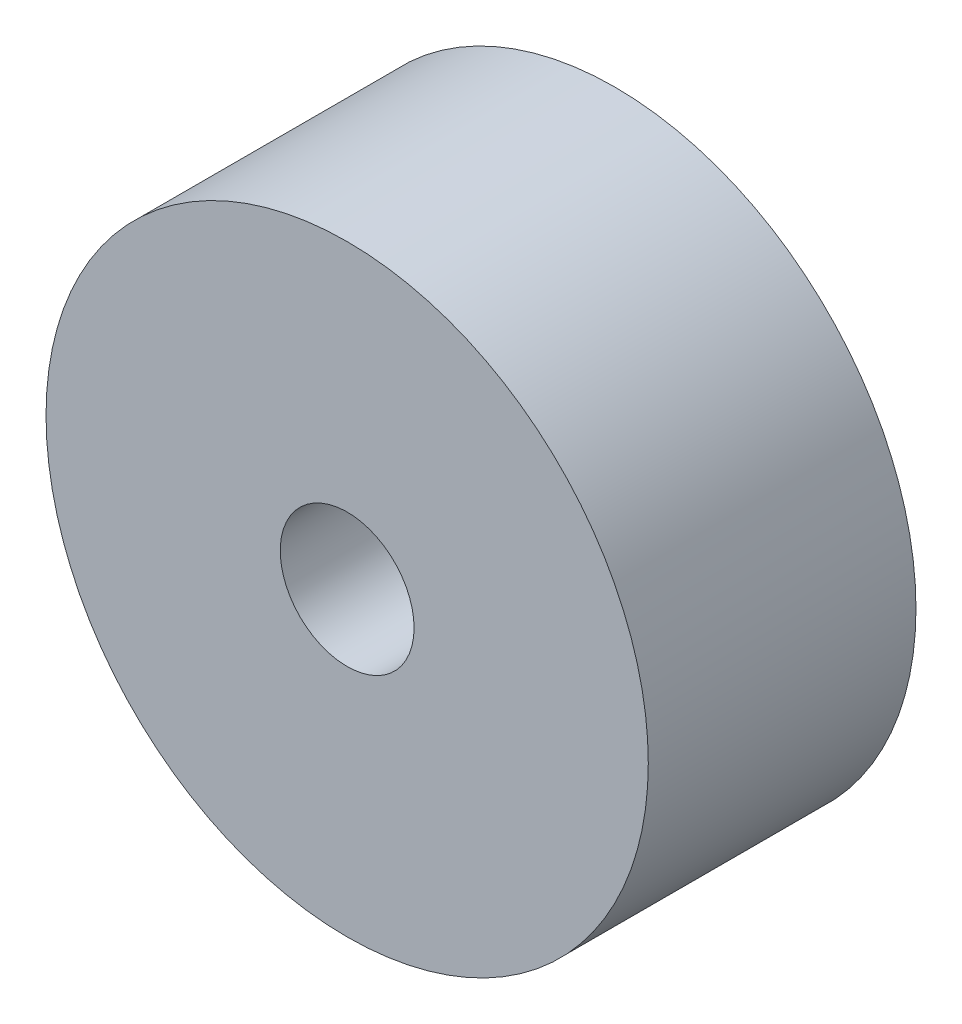
ISO-10303-21;
HEADER;
FILE_DESCRIPTION(('STEP AP214'),'2;1');
FILE_NAME('part.step','',(''),(''),'','','');
FILE_SCHEMA(('AUTOMOTIVE_DESIGN { 1 0 10303 214 1 1 1 1 }'));
ENDSEC;
DATA;
#1=APPLICATION_CONTEXT('core data for automotive mechanical design processes');
#2=APPLICATION_PROTOCOL_DEFINITION('international standard','automotive_design',2000,#1);
#3=PRODUCT_CONTEXT('',#1,'mechanical');
#4=PRODUCT('Part','Part','',(#3));
#5=PRODUCT_RELATED_PRODUCT_CATEGORY('part','',(#4));
#6=PRODUCT_DEFINITION_FORMATION('','',#4);
#7=PRODUCT_DEFINITION_CONTEXT('part definition',#1,'design');
#8=PRODUCT_DEFINITION('design','',#6,#7);
#9=PRODUCT_DEFINITION_SHAPE('','',#8);
#10=(LENGTH_UNIT() NAMED_UNIT(*) SI_UNIT(.MILLI.,.METRE.));
#11=(NAMED_UNIT(*) PLANE_ANGLE_UNIT() SI_UNIT($,.RADIAN.));
#12=(NAMED_UNIT(*) SI_UNIT($,.STERADIAN.) SOLID_ANGLE_UNIT());
#13=UNCERTAINTY_MEASURE_WITH_UNIT(LENGTH_MEASURE(1.E-05),#10,'distance_accuracy_value','');
#14=(GEOMETRIC_REPRESENTATION_CONTEXT(3) GLOBAL_UNCERTAINTY_ASSIGNED_CONTEXT((#13)) GLOBAL_UNIT_ASSIGNED_CONTEXT((#10,
#11,#12)) REPRESENTATION_CONTEXT('',''));
#15=CARTESIAN_POINT('',(0.,0.,0.));
#16=DIRECTION('',(0.,0.,1.));
#17=DIRECTION('',(1.,0.,0.));
#18=AXIS2_PLACEMENT_3D('',#15,#16,#17);
#19=CARTESIAN_POINT('',(0.,0.,20.));
#20=DIRECTION('',(0.,0.,1.));
#21=DIRECTION('',(1.,0.,0.));
#22=AXIS2_PLACEMENT_3D('',#19,#20,#21);
#23=PLANE('',#22);
#24=CARTESIAN_POINT('',(0.,0.,20.));
#25=DIRECTION('',(0.,0.,1.));
#26=DIRECTION('',(1.,0.,0.));
#27=AXIS2_PLACEMENT_3D('',#24,#25,#26);
#28=CIRCLE('',#27,22.5);
#29=CARTESIAN_POINT('',(22.5,0.,20.));
#30=VERTEX_POINT('',#29);
#31=EDGE_CURVE('E10',#30,#30,#28,.T.);
#32=ORIENTED_EDGE('',*,*,#31,.T.);
#33=EDGE_LOOP('',(#32));
#34=FACE_BOUND('',#33,.T.);
#35=CARTESIAN_POINT('',(0.,0.,20.));
#36=DIRECTION('',(0.,0.,1.));
#37=DIRECTION('',(1.,0.,0.));
#38=AXIS2_PLACEMENT_3D('',#35,#36,#37);
#39=CIRCLE('',#38,5.);
#40=CARTESIAN_POINT('',(5.,0.,20.));
#41=VERTEX_POINT('',#40);
#42=EDGE_CURVE('E43',#41,#41,#39,.T.);
#43=ORIENTED_EDGE('',*,*,#42,.F.);
#44=EDGE_LOOP('',(#43));
#45=FACE_BOUND('',#44,.T.);
#46=ADVANCED_FACE('F32',(#34,#45),#23,.T.);
#47=CARTESIAN_POINT('',(0.,0.,0.));
#48=DIRECTION('',(0.,0.,1.));
#49=DIRECTION('',(1.,0.,0.));
#50=AXIS2_PLACEMENT_3D('',#47,#48,#49);
#51=PLANE('',#50);
#52=CARTESIAN_POINT('',(0.,0.,0.));
#53=DIRECTION('',(0.,0.,1.));
#54=DIRECTION('',(1.,0.,0.));
#55=AXIS2_PLACEMENT_3D('',#52,#53,#54);
#56=CIRCLE('',#55,22.5);
#57=CARTESIAN_POINT('',(22.5,0.,0.));
#58=VERTEX_POINT('',#57);
#59=EDGE_CURVE('E36',#58,#58,#56,.T.);
#60=ORIENTED_EDGE('',*,*,#59,.F.);
#61=EDGE_LOOP('',(#60));
#62=FACE_BOUND('',#61,.T.);
#63=CARTESIAN_POINT('',(0.,0.,0.));
#64=DIRECTION('',(0.,0.,1.));
#65=DIRECTION('',(1.,0.,0.));
#66=AXIS2_PLACEMENT_3D('',#63,#64,#65);
#67=CIRCLE('',#66,5.);
#68=CARTESIAN_POINT('',(5.,0.,0.));
#69=VERTEX_POINT('',#68);
#70=EDGE_CURVE('E45',#69,#69,#67,.T.);
#71=ORIENTED_EDGE('',*,*,#70,.T.);
#72=EDGE_LOOP('',(#71));
#73=FACE_BOUND('',#72,.T.);
#74=ADVANCED_FACE('F55',(#62,#73),#51,.F.);
#75=CARTESIAN_POINT('',(0.,0.,20.));
#76=DIRECTION('',(0.,0.,-1.));
#77=DIRECTION('',(-1.,0.,0.));
#78=AXIS2_PLACEMENT_3D('',#75,#76,#77);
#79=CYLINDRICAL_SURFACE('',#78,22.5);
#80=ORIENTED_EDGE('',*,*,#31,.F.);
#81=EDGE_LOOP('',(#80));
#82=FACE_BOUND('',#81,.T.);
#83=ORIENTED_EDGE('',*,*,#59,.T.);
#84=EDGE_LOOP('',(#83));
#85=FACE_BOUND('',#84,.T.);
#86=ADVANCED_FACE('F34',(#82,#85),#79,.T.);
#87=CARTESIAN_POINT('',(0.,0.,20.));
#88=DIRECTION('',(0.,0.,-1.));
#89=DIRECTION('',(-1.,0.,0.));
#90=AXIS2_PLACEMENT_3D('',#87,#88,#89);
#91=CYLINDRICAL_SURFACE('',#90,5.);
#92=ORIENTED_EDGE('',*,*,#42,.T.);
#93=EDGE_LOOP('',(#92));
#94=FACE_BOUND('',#93,.T.);
#95=ORIENTED_EDGE('',*,*,#70,.F.);
#96=EDGE_LOOP('',(#95));
#97=FACE_BOUND('',#96,.T.);
#98=ADVANCED_FACE('F51',(#94,#97),#91,.F.);
#99=CLOSED_SHELL('',(#46,#74,#86,#98));
#100=MANIFOLD_SOLID_BREP('B2',#99);
#101=ADVANCED_BREP_SHAPE_REPRESENTATION('',(#18,#100),#14);
#102=SHAPE_DEFINITION_REPRESENTATION(#9,#101);
ENDSEC;
END-ISO-10303-21;
